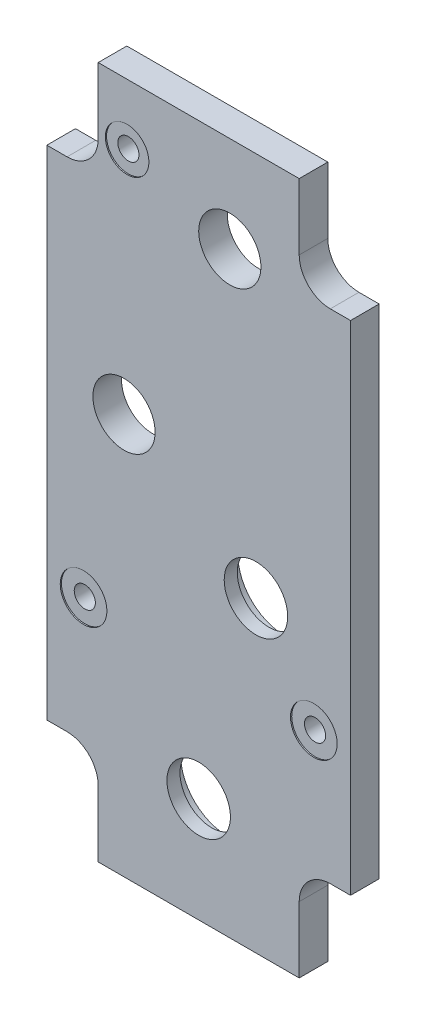
ISO-10303-21;
HEADER;
FILE_DESCRIPTION(('STEP AP214'),'2;1');
FILE_NAME('part.step','',(''),(''),'','','');
FILE_SCHEMA(('AUTOMOTIVE_DESIGN { 1 0 10303 214 1 1 1 1 }'));
ENDSEC;
DATA;
#1=APPLICATION_CONTEXT('core data for automotive mechanical design processes');
#2=APPLICATION_PROTOCOL_DEFINITION('international standard','automotive_design',2000,#1);
#3=PRODUCT_CONTEXT('',#1,'mechanical');
#4=PRODUCT('Part','Part','',(#3));
#5=PRODUCT_RELATED_PRODUCT_CATEGORY('part','',(#4));
#6=PRODUCT_DEFINITION_FORMATION('','',#4);
#7=PRODUCT_DEFINITION_CONTEXT('part definition',#1,'design');
#8=PRODUCT_DEFINITION('design','',#6,#7);
#9=PRODUCT_DEFINITION_SHAPE('','',#8);
#10=(LENGTH_UNIT() NAMED_UNIT(*) SI_UNIT(.MILLI.,.METRE.));
#11=(NAMED_UNIT(*) PLANE_ANGLE_UNIT() SI_UNIT($,.RADIAN.));
#12=(NAMED_UNIT(*) SI_UNIT($,.STERADIAN.) SOLID_ANGLE_UNIT());
#13=UNCERTAINTY_MEASURE_WITH_UNIT(LENGTH_MEASURE(1.E-05),#10,'distance_accuracy_value','');
#14=(GEOMETRIC_REPRESENTATION_CONTEXT(3) GLOBAL_UNCERTAINTY_ASSIGNED_CONTEXT((#13)) GLOBAL_UNIT_ASSIGNED_CONTEXT((#10,
#11,#12)) REPRESENTATION_CONTEXT('',''));
#15=CARTESIAN_POINT('',(0.,0.,0.));
#16=DIRECTION('',(0.,0.,1.));
#17=DIRECTION('',(1.,0.,0.));
#18=AXIS2_PLACEMENT_3D('',#15,#16,#17);
#19=CARTESIAN_POINT('',(8.255,55.5625,7.4676));
#20=DIRECTION('',(0.,0.,-1.));
#21=DIRECTION('',(-1.,0.,0.));
#22=AXIS2_PLACEMENT_3D('',#19,#20,#21);
#23=CYLINDRICAL_SURFACE('',#22,2.159);
#24=CARTESIAN_POINT('',(8.255,55.5625,1.6256));
#25=DIRECTION('',(0.,0.,-1.));
#26=DIRECTION('',(-1.,0.,0.));
#27=AXIS2_PLACEMENT_3D('',#24,#25,#26);
#28=CIRCLE('',#27,2.159);
#29=CARTESIAN_POINT('',(6.096,55.5625,1.6256));
#30=VERTEX_POINT('',#29);
#31=EDGE_CURVE('E323',#30,#30,#28,.T.);
#32=ORIENTED_EDGE('',*,*,#31,.T.);
#33=EDGE_LOOP('',(#32));
#34=FACE_BOUND('',#33,.T.);
#35=CARTESIAN_POINT('',(8.255,55.5625,7.2136));
#36=DIRECTION('',(0.,0.,-1.));
#37=DIRECTION('',(-1.,0.,0.));
#38=AXIS2_PLACEMENT_3D('',#35,#36,#37);
#39=CIRCLE('',#38,2.159);
#40=CARTESIAN_POINT('',(6.096,55.5625,7.2136));
#41=VERTEX_POINT('',#40);
#42=EDGE_CURVE('E20',#41,#41,#39,.T.);
#43=ORIENTED_EDGE('',*,*,#42,.F.);
#44=EDGE_LOOP('',(#43));
#45=FACE_BOUND('',#44,.T.);
#46=ADVANCED_FACE('F17',(#34,#45),#23,.F.);
#47=CARTESIAN_POINT('',(55.245,55.5625,7.4676));
#48=DIRECTION('',(0.,0.,-1.));
#49=DIRECTION('',(-1.,0.,0.));
#50=AXIS2_PLACEMENT_3D('',#47,#48,#49);
#51=CYLINDRICAL_SURFACE('',#50,2.15900000000001);
#52=CARTESIAN_POINT('',(55.245,55.5625,1.6256));
#53=DIRECTION('',(0.,0.,-1.));
#54=DIRECTION('',(-1.,0.,0.));
#55=AXIS2_PLACEMENT_3D('',#52,#53,#54);
#56=CIRCLE('',#55,2.15900000000001);
#57=CARTESIAN_POINT('',(53.086,55.5625,1.6256));
#58=VERTEX_POINT('',#57);
#59=EDGE_CURVE('E320',#58,#58,#56,.T.);
#60=ORIENTED_EDGE('',*,*,#59,.T.);
#61=EDGE_LOOP('',(#60));
#62=FACE_BOUND('',#61,.T.);
#63=CARTESIAN_POINT('',(55.245,55.5625,7.2136));
#64=DIRECTION('',(0.,0.,-1.));
#65=DIRECTION('',(-1.,0.,0.));
#66=AXIS2_PLACEMENT_3D('',#63,#64,#65);
#67=CIRCLE('',#66,2.15900000000001);
#68=CARTESIAN_POINT('',(53.086,55.5625,7.2136));
#69=VERTEX_POINT('',#68);
#70=EDGE_CURVE('E335',#69,#69,#67,.T.);
#71=ORIENTED_EDGE('',*,*,#70,.F.);
#72=EDGE_LOOP('',(#71));
#73=FACE_BOUND('',#72,.T.);
#74=ADVANCED_FACE('F346',(#62,#73),#51,.F.);
#75=CARTESIAN_POINT('',(17.145,139.192,7.4676));
#76=DIRECTION('',(0.,0.,-1.));
#77=DIRECTION('',(-1.,0.,0.));
#78=AXIS2_PLACEMENT_3D('',#75,#76,#77);
#79=CYLINDRICAL_SURFACE('',#78,2.159);
#80=CARTESIAN_POINT('',(17.145,139.192,1.6256));
#81=DIRECTION('',(0.,0.,-1.));
#82=DIRECTION('',(-1.,0.,0.));
#83=AXIS2_PLACEMENT_3D('',#80,#81,#82);
#84=CIRCLE('',#83,2.159);
#85=CARTESIAN_POINT('',(14.986,139.192,1.6256));
#86=VERTEX_POINT('',#85);
#87=EDGE_CURVE('E317',#86,#86,#84,.T.);
#88=ORIENTED_EDGE('',*,*,#87,.T.);
#89=EDGE_LOOP('',(#88));
#90=FACE_BOUND('',#89,.T.);
#91=CARTESIAN_POINT('',(17.145,139.192,7.2136));
#92=DIRECTION('',(0.,0.,-1.));
#93=DIRECTION('',(-1.,0.,0.));
#94=AXIS2_PLACEMENT_3D('',#91,#92,#93);
#95=CIRCLE('',#94,2.159);
#96=CARTESIAN_POINT('',(14.986,139.192,7.2136));
#97=VERTEX_POINT('',#96);
#98=EDGE_CURVE('E333',#97,#97,#95,.T.);
#99=ORIENTED_EDGE('',*,*,#98,.F.);
#100=EDGE_LOOP('',(#99));
#101=FACE_BOUND('',#100,.T.);
#102=ADVANCED_FACE('F352',(#90,#101),#79,.F.);
#103=CARTESIAN_POINT('',(31.75,31.75,1.6256));
#104=DIRECTION('',(0.,0.,1.));
#105=DIRECTION('',(1.,0.,0.));
#106=AXIS2_PLACEMENT_3D('',#103,#104,#105);
#107=CYLINDRICAL_SURFACE('',#106,9.525);
#108=CARTESIAN_POINT('',(31.75,31.75,4.8006));
#109=DIRECTION('',(0.,0.,1.));
#110=DIRECTION('',(1.,0.,0.));
#111=AXIS2_PLACEMENT_3D('',#108,#109,#110);
#112=CIRCLE('',#111,9.525);
#113=CARTESIAN_POINT('',(41.275,31.75,4.8006));
#114=VERTEX_POINT('',#113);
#115=EDGE_CURVE('E326',#114,#114,#112,.F.);
#116=ORIENTED_EDGE('',*,*,#115,.F.);
#117=EDGE_LOOP('',(#116));
#118=FACE_BOUND('',#117,.T.);
#119=CARTESIAN_POINT('',(31.75,31.75,1.6256));
#120=DIRECTION('',(0.,0.,1.));
#121=DIRECTION('',(1.,0.,0.));
#122=AXIS2_PLACEMENT_3D('',#119,#120,#121);
#123=CIRCLE('',#122,9.525);
#124=CARTESIAN_POINT('',(41.275,31.75,1.6256));
#125=VERTEX_POINT('',#124);
#126=EDGE_CURVE('E314',#125,#125,#123,.F.);
#127=ORIENTED_EDGE('',*,*,#126,.T.);
#128=EDGE_LOOP('',(#127));
#129=FACE_BOUND('',#128,.T.);
#130=ADVANCED_FACE('F470',(#118,#129),#107,.F.);
#131=CARTESIAN_POINT('',(43.434,73.025,1.6256));
#132=DIRECTION('',(0.,0.,1.));
#133=DIRECTION('',(1.,0.,0.));
#134=AXIS2_PLACEMENT_3D('',#131,#132,#133);
#135=CYLINDRICAL_SURFACE('',#134,9.525);
#136=CARTESIAN_POINT('',(43.434,73.025,4.8006));
#137=DIRECTION('',(0.,0.,1.));
#138=DIRECTION('',(1.,0.,0.));
#139=AXIS2_PLACEMENT_3D('',#136,#137,#138);
#140=CIRCLE('',#139,9.525);
#141=CARTESIAN_POINT('',(52.959,73.025,4.8006));
#142=VERTEX_POINT('',#141);
#143=EDGE_CURVE('E329',#142,#142,#140,.F.);
#144=ORIENTED_EDGE('',*,*,#143,.F.);
#145=EDGE_LOOP('',(#144));
#146=FACE_BOUND('',#145,.T.);
#147=CARTESIAN_POINT('',(43.434,73.025,1.6256));
#148=DIRECTION('',(0.,0.,1.));
#149=DIRECTION('',(1.,0.,0.));
#150=AXIS2_PLACEMENT_3D('',#147,#148,#149);
#151=CIRCLE('',#150,9.525);
#152=CARTESIAN_POINT('',(52.959,73.025,1.6256));
#153=VERTEX_POINT('',#152);
#154=EDGE_CURVE('E197',#153,#153,#151,.F.);
#155=ORIENTED_EDGE('',*,*,#154,.T.);
#156=EDGE_LOOP('',(#155));
#157=FACE_BOUND('',#156,.T.);
#158=ADVANCED_FACE('F467',(#146,#157),#135,.F.);
#159=CARTESIAN_POINT('',(8.255,55.5625,7.2136));
#160=DIRECTION('',(0.,0.,1.));
#161=DIRECTION('',(1.,0.,0.));
#162=AXIS2_PLACEMENT_3D('',#159,#160,#161);
#163=PLANE('',#162);
#164=ORIENTED_EDGE('',*,*,#42,.T.);
#165=EDGE_LOOP('',(#164));
#166=FACE_BOUND('',#165,.T.);
#167=CARTESIAN_POINT('',(8.255,55.5625,7.2136));
#168=DIRECTION('',(0.,0.,-1.));
#169=DIRECTION('',(-1.,0.,0.));
#170=AXIS2_PLACEMENT_3D('',#167,#168,#169);
#171=CIRCLE('',#170,4.7625);
#172=CARTESIAN_POINT('',(3.4925,55.5625,7.2136));
#173=VERTEX_POINT('',#172);
#174=EDGE_CURVE('E300',#173,#173,#171,.F.);
#175=ORIENTED_EDGE('',*,*,#174,.T.);
#176=EDGE_LOOP('',(#175));
#177=FACE_BOUND('',#176,.T.);
#178=ADVANCED_FACE('F342',(#166,#177),#163,.T.);
#179=CARTESIAN_POINT('',(55.245,55.5625,7.2136));
#180=DIRECTION('',(0.,0.,1.));
#181=DIRECTION('',(1.,0.,0.));
#182=AXIS2_PLACEMENT_3D('',#179,#180,#181);
#183=PLANE('',#182);
#184=ORIENTED_EDGE('',*,*,#70,.T.);
#185=EDGE_LOOP('',(#184));
#186=FACE_BOUND('',#185,.T.);
#187=CARTESIAN_POINT('',(55.245,55.5625,7.2136));
#188=DIRECTION('',(0.,0.,-1.));
#189=DIRECTION('',(-1.,0.,0.));
#190=AXIS2_PLACEMENT_3D('',#187,#188,#189);
#191=CIRCLE('',#190,4.7625);
#192=CARTESIAN_POINT('',(50.4825,55.5625,7.2136));
#193=VERTEX_POINT('',#192);
#194=EDGE_CURVE('E297',#193,#193,#191,.F.);
#195=ORIENTED_EDGE('',*,*,#194,.T.);
#196=EDGE_LOOP('',(#195));
#197=FACE_BOUND('',#196,.T.);
#198=ADVANCED_FACE('F461',(#186,#197),#183,.T.);
#199=CARTESIAN_POINT('',(17.145,139.192,7.2136));
#200=DIRECTION('',(0.,0.,1.));
#201=DIRECTION('',(1.,0.,0.));
#202=AXIS2_PLACEMENT_3D('',#199,#200,#201);
#203=PLANE('',#202);
#204=ORIENTED_EDGE('',*,*,#98,.T.);
#205=EDGE_LOOP('',(#204));
#206=FACE_BOUND('',#205,.T.);
#207=CARTESIAN_POINT('',(17.145,139.192,7.2136));
#208=DIRECTION('',(0.,0.,-1.));
#209=DIRECTION('',(-1.,0.,0.));
#210=AXIS2_PLACEMENT_3D('',#207,#208,#209);
#211=CIRCLE('',#210,4.445);
#212=CARTESIAN_POINT('',(12.7,139.192,7.2136));
#213=VERTEX_POINT('',#212);
#214=EDGE_CURVE('E294',#213,#213,#211,.F.);
#215=ORIENTED_EDGE('',*,*,#214,.T.);
#216=EDGE_LOOP('',(#215));
#217=FACE_BOUND('',#216,.T.);
#218=ADVANCED_FACE('F457',(#206,#217),#203,.T.);
#219=CARTESIAN_POINT('',(43.434,73.025,4.8006));
#220=DIRECTION('',(0.,0.,-1.));
#221=DIRECTION('',(-1.,0.,0.));
#222=AXIS2_PLACEMENT_3D('',#219,#220,#221);
#223=PLANE('',#222);
#224=CARTESIAN_POINT('',(43.434,73.025,4.8006));
#225=DIRECTION('',(0.,0.,-1.));
#226=DIRECTION('',(-1.,0.,0.));
#227=AXIS2_PLACEMENT_3D('',#224,#225,#226);
#228=CIRCLE('',#227,6.477);
#229=CARTESIAN_POINT('',(36.957,73.025,4.8006));
#230=VERTEX_POINT('',#229);
#231=EDGE_CURVE('E290',#230,#230,#228,.F.);
#232=ORIENTED_EDGE('',*,*,#231,.T.);
#233=EDGE_LOOP('',(#232));
#234=FACE_BOUND('',#233,.T.);
#235=ORIENTED_EDGE('',*,*,#143,.T.);
#236=EDGE_LOOP('',(#235));
#237=FACE_BOUND('',#236,.T.);
#238=ADVANCED_FACE('F453',(#234,#237),#223,.T.);
#239=CARTESIAN_POINT('',(31.75,31.75,4.8006));
#240=DIRECTION('',(0.,0.,-1.));
#241=DIRECTION('',(-1.,0.,0.));
#242=AXIS2_PLACEMENT_3D('',#239,#240,#241);
#243=PLANE('',#242);
#244=CARTESIAN_POINT('',(31.75,31.75,4.8006));
#245=DIRECTION('',(0.,0.,-1.));
#246=DIRECTION('',(-1.,0.,0.));
#247=AXIS2_PLACEMENT_3D('',#244,#245,#246);
#248=CIRCLE('',#247,6.477);
#249=CARTESIAN_POINT('',(25.273,31.75,4.8006));
#250=VERTEX_POINT('',#249);
#251=EDGE_CURVE('E284',#250,#250,#248,.F.);
#252=ORIENTED_EDGE('',*,*,#251,.T.);
#253=EDGE_LOOP('',(#252));
#254=FACE_BOUND('',#253,.T.);
#255=ORIENTED_EDGE('',*,*,#115,.T.);
#256=EDGE_LOOP('',(#255));
#257=FACE_BOUND('',#256,.T.);
#258=ADVANCED_FACE('F449',(#254,#257),#243,.T.);
#259=CARTESIAN_POINT('',(31.75,80.9625,1.6256));
#260=DIRECTION('',(0.,0.,1.));
#261=DIRECTION('',(1.,0.,0.));
#262=AXIS2_PLACEMENT_3D('',#259,#260,#261);
#263=PLANE('',#262);
#264=CARTESIAN_POINT('',(38.1,132.08,1.6256));
#265=DIRECTION('',(0.,0.,-1.));
#266=DIRECTION('',(-1.,0.,0.));
#267=AXIS2_PLACEMENT_3D('',#264,#265,#266);
#268=CIRCLE('',#267,6.35);
#269=CARTESIAN_POINT('',(31.75,132.08,1.6256));
#270=VERTEX_POINT('',#269);
#271=EDGE_CURVE('E281',#270,#270,#268,.F.);
#272=ORIENTED_EDGE('',*,*,#271,.T.);
#273=EDGE_LOOP('',(#272));
#274=FACE_BOUND('',#273,.T.);
#275=CARTESIAN_POINT('',(16.51,92.075,1.6256));
#276=DIRECTION('',(0.,0.,-1.));
#277=DIRECTION('',(-1.,0.,0.));
#278=AXIS2_PLACEMENT_3D('',#275,#276,#277);
#279=CIRCLE('',#278,6.35);
#280=CARTESIAN_POINT('',(10.16,92.075,1.6256));
#281=VERTEX_POINT('',#280);
#282=EDGE_CURVE('E287',#281,#281,#279,.F.);
#283=ORIENTED_EDGE('',*,*,#282,.T.);
#284=EDGE_LOOP('',(#283));
#285=FACE_BOUND('',#284,.T.);
#286=ORIENTED_EDGE('',*,*,#154,.F.);
#287=EDGE_LOOP('',(#286));
#288=FACE_BOUND('',#287,.T.);
#289=ORIENTED_EDGE('',*,*,#126,.F.);
#290=EDGE_LOOP('',(#289));
#291=FACE_BOUND('',#290,.T.);
#292=ORIENTED_EDGE('',*,*,#87,.F.);
#293=EDGE_LOOP('',(#292));
#294=FACE_BOUND('',#293,.T.);
#295=ORIENTED_EDGE('',*,*,#59,.F.);
#296=EDGE_LOOP('',(#295));
#297=FACE_BOUND('',#296,.T.);
#298=ORIENTED_EDGE('',*,*,#31,.F.);
#299=EDGE_LOOP('',(#298));
#300=FACE_BOUND('',#299,.T.);
#301=DIRECTION('',(0.,1.,0.));
#302=VECTOR('',#301,1.);
#303=CARTESIAN_POINT('',(11.2394999999999,23.8125,1.6256));
#304=LINE('',#303,#302);
#305=CARTESIAN_POINT('',(11.2394999999999,23.8125,1.6256));
#306=VERTEX_POINT('',#305);
#307=CARTESIAN_POINT('',(11.2394999999999,10.31875,1.6256));
#308=VERTEX_POINT('',#307);
#309=EDGE_CURVE('E189',#306,#308,#304,.F.);
#310=ORIENTED_EDGE('',*,*,#309,.F.);
#311=CARTESIAN_POINT('',(4.88949999999995,23.8125,1.6256));
#312=DIRECTION('',(0.,0.,1.));
#313=DIRECTION('',(1.,0.,0.));
#314=AXIS2_PLACEMENT_3D('',#311,#312,#313);
#315=CIRCLE('',#314,6.35);
#316=CARTESIAN_POINT('',(4.88949999999992,30.1625,1.6256));
#317=VERTEX_POINT('',#316);
#318=EDGE_CURVE('E193',#306,#317,#315,.T.);
#319=ORIENTED_EDGE('',*,*,#318,.T.);
#320=DIRECTION('',(1.,0.,0.));
#321=VECTOR('',#320,1.);
#322=CARTESIAN_POINT('',(0.76200000000003,30.1625,1.6256));
#323=LINE('',#322,#321);
#324=CARTESIAN_POINT('',(0.762000000000034,30.1625,1.6256));
#325=VERTEX_POINT('',#324);
#326=EDGE_CURVE('E200',#325,#317,#323,.T.);
#327=ORIENTED_EDGE('',*,*,#326,.F.);
#328=DIRECTION('',(0.,-1.,0.));
#329=VECTOR('',#328,1.);
#330=CARTESIAN_POINT('',(0.76199999999986,131.7625,1.6256));
#331=LINE('',#330,#329);
#332=CARTESIAN_POINT('',(0.76199999999986,131.7625,1.6256));
#333=VERTEX_POINT('',#332);
#334=EDGE_CURVE('E206',#333,#325,#331,.T.);
#335=ORIENTED_EDGE('',*,*,#334,.F.);
#336=DIRECTION('',(-1.,0.,0.));
#337=VECTOR('',#336,1.);
#338=CARTESIAN_POINT('',(4.88949999999995,131.7625,1.6256));
#339=LINE('',#338,#337);
#340=CARTESIAN_POINT('',(4.88949999999992,131.7625,1.6256));
#341=VERTEX_POINT('',#340);
#342=EDGE_CURVE('E212',#341,#333,#339,.T.);
#343=ORIENTED_EDGE('',*,*,#342,.F.);
#344=CARTESIAN_POINT('',(4.88949999999995,138.1125,1.6256));
#345=DIRECTION('',(0.,0.,1.));
#346=DIRECTION('',(1.,0.,0.));
#347=AXIS2_PLACEMENT_3D('',#344,#345,#346);
#348=CIRCLE('',#347,6.35);
#349=CARTESIAN_POINT('',(11.2394999999999,138.1125,1.6256));
#350=VERTEX_POINT('',#349);
#351=EDGE_CURVE('E215',#341,#350,#348,.T.);
#352=ORIENTED_EDGE('',*,*,#351,.T.);
#353=DIRECTION('',(0.,1.,0.));
#354=VECTOR('',#353,1.);
#355=CARTESIAN_POINT('',(11.2394999999999,151.60625,1.6256));
#356=LINE('',#355,#354);
#357=CARTESIAN_POINT('',(11.2395,151.60625,1.6256));
#358=VERTEX_POINT('',#357);
#359=EDGE_CURVE('E218',#358,#350,#356,.F.);
#360=ORIENTED_EDGE('',*,*,#359,.F.);
#361=DIRECTION('',(-1.,0.,0.));
#362=VECTOR('',#361,1.);
#363=CARTESIAN_POINT('',(52.2605,151.60625,1.6256));
#364=LINE('',#363,#362);
#365=CARTESIAN_POINT('',(52.2605,151.60625,1.6256));
#366=VERTEX_POINT('',#365);
#367=EDGE_CURVE('E224',#366,#358,#364,.T.);
#368=ORIENTED_EDGE('',*,*,#367,.F.);
#369=DIRECTION('',(0.,1.,0.));
#370=VECTOR('',#369,1.);
#371=CARTESIAN_POINT('',(52.2605,138.1125,1.6256));
#372=LINE('',#371,#370);
#373=CARTESIAN_POINT('',(52.2605,138.1125,1.6256));
#374=VERTEX_POINT('',#373);
#375=EDGE_CURVE('E230',#374,#366,#372,.T.);
#376=ORIENTED_EDGE('',*,*,#375,.F.);
#377=CARTESIAN_POINT('',(58.6105,138.1125,1.6256));
#378=DIRECTION('',(0.,0.,1.));
#379=DIRECTION('',(1.,0.,0.));
#380=AXIS2_PLACEMENT_3D('',#377,#378,#379);
#381=CIRCLE('',#380,6.35);
#382=CARTESIAN_POINT('',(58.6105,131.7625,1.6256));
#383=VERTEX_POINT('',#382);
#384=EDGE_CURVE('E147',#374,#383,#381,.T.);
#385=ORIENTED_EDGE('',*,*,#384,.T.);
#386=DIRECTION('',(-1.,0.,0.));
#387=VECTOR('',#386,1.);
#388=CARTESIAN_POINT('',(62.738,131.7625,1.6256));
#389=LINE('',#388,#387);
#390=CARTESIAN_POINT('',(62.738,131.7625,1.6256));
#391=VERTEX_POINT('',#390);
#392=EDGE_CURVE('E142',#391,#383,#389,.T.);
#393=ORIENTED_EDGE('',*,*,#392,.F.);
#394=DIRECTION('',(0.,1.,0.));
#395=VECTOR('',#394,1.);
#396=CARTESIAN_POINT('',(62.738,30.1625,1.6256));
#397=LINE('',#396,#395);
#398=CARTESIAN_POINT('',(62.738,30.1625,1.6256));
#399=VERTEX_POINT('',#398);
#400=EDGE_CURVE('E145',#399,#391,#397,.T.);
#401=ORIENTED_EDGE('',*,*,#400,.F.);
#402=DIRECTION('',(1.,0.,0.));
#403=VECTOR('',#402,1.);
#404=CARTESIAN_POINT('',(58.6105,30.1625,1.6256));
#405=LINE('',#404,#403);
#406=CARTESIAN_POINT('',(58.6105,30.1625,1.6256));
#407=VERTEX_POINT('',#406);
#408=EDGE_CURVE('E96',#407,#399,#405,.T.);
#409=ORIENTED_EDGE('',*,*,#408,.F.);
#410=CARTESIAN_POINT('',(58.6105,23.8125,1.6256));
#411=DIRECTION('',(0.,0.,1.));
#412=DIRECTION('',(1.,0.,0.));
#413=AXIS2_PLACEMENT_3D('',#410,#411,#412);
#414=CIRCLE('',#413,6.35);
#415=CARTESIAN_POINT('',(52.2605,23.8125,1.6256));
#416=VERTEX_POINT('',#415);
#417=EDGE_CURVE('E184',#407,#416,#414,.T.);
#418=ORIENTED_EDGE('',*,*,#417,.T.);
#419=DIRECTION('',(0.,1.,0.));
#420=VECTOR('',#419,1.);
#421=CARTESIAN_POINT('',(52.2605,10.31875,1.6256));
#422=LINE('',#421,#420);
#423=CARTESIAN_POINT('',(52.2605,10.3187500000001,1.6256));
#424=VERTEX_POINT('',#423);
#425=EDGE_CURVE('E104',#424,#416,#422,.T.);
#426=ORIENTED_EDGE('',*,*,#425,.F.);
#427=DIRECTION('',(1.,0.,0.));
#428=VECTOR('',#427,1.);
#429=CARTESIAN_POINT('',(11.2394999999999,10.31875,1.6256));
#430=LINE('',#429,#428);
#431=EDGE_CURVE('E110',#308,#424,#430,.T.);
#432=ORIENTED_EDGE('',*,*,#431,.F.);
#433=EDGE_LOOP('',(#310,#319,#327,#335,#343,#352,#360,#368,#376,#385,#393,#401,#409,#418,#426,#432));
#434=FACE_BOUND('',#433,.T.);
#435=ADVANCED_FACE('F144',(#274,#285,#288,#291,#294,#297,#300,#434),#263,.F.);
#436=CARTESIAN_POINT('',(11.2394999999999,10.31875,1.6256));
#437=DIRECTION('',(0.,-1.,0.));
#438=DIRECTION('',(1.,0.,0.));
#439=AXIS2_PLACEMENT_3D('',#436,#437,#438);
#440=PLANE('',#439);
#441=DIRECTION('',(1.,0.,0.));
#442=VECTOR('',#441,1.);
#443=CARTESIAN_POINT('',(31.75,10.31875,7.4676));
#444=LINE('',#443,#442);
#445=CARTESIAN_POINT('',(11.2395,10.31875,7.4676));
#446=VERTEX_POINT('',#445);
#447=CARTESIAN_POINT('',(52.2605,10.31875,7.4676));
#448=VERTEX_POINT('',#447);
#449=EDGE_CURVE('E117',#446,#448,#444,.T.);
#450=ORIENTED_EDGE('',*,*,#449,.F.);
#451=DIRECTION('',(0.,0.,1.));
#452=VECTOR('',#451,1.);
#453=CARTESIAN_POINT('',(11.2394999999999,10.31875,1.6256));
#454=LINE('',#453,#452);
#455=EDGE_CURVE('E192',#308,#446,#454,.T.);
#456=ORIENTED_EDGE('',*,*,#455,.F.);
#457=ORIENTED_EDGE('',*,*,#431,.T.);
#458=DIRECTION('',(0.,0.,1.));
#459=VECTOR('',#458,1.);
#460=CARTESIAN_POINT('',(52.2605,10.31875,1.6256));
#461=LINE('',#460,#459);
#462=EDGE_CURVE('E185',#448,#424,#461,.F.);
#463=ORIENTED_EDGE('',*,*,#462,.F.);
#464=EDGE_LOOP('',(#450,#456,#457,#463));
#465=FACE_BOUND('',#464,.T.);
#466=ADVANCED_FACE('F444',(#465),#440,.T.);
#467=CARTESIAN_POINT('',(52.2605,10.31875,1.6256));
#468=DIRECTION('',(1.,0.,0.));
#469=DIRECTION('',(0.,1.,0.));
#470=AXIS2_PLACEMENT_3D('',#467,#468,#469);
#471=PLANE('',#470);
#472=DIRECTION('',(0.,1.,0.));
#473=VECTOR('',#472,1.);
#474=CARTESIAN_POINT('',(52.2605,80.9625,7.4676));
#475=LINE('',#474,#473);
#476=CARTESIAN_POINT('',(52.2605,23.8125,7.4676));
#477=VERTEX_POINT('',#476);
#478=EDGE_CURVE('E280',#448,#477,#475,.T.);
#479=ORIENTED_EDGE('',*,*,#478,.F.);
#480=ORIENTED_EDGE('',*,*,#462,.T.);
#481=ORIENTED_EDGE('',*,*,#425,.T.);
#482=DIRECTION('',(0.,0.,1.));
#483=VECTOR('',#482,1.);
#484=CARTESIAN_POINT('',(52.2605,23.8125,1.6256));
#485=LINE('',#484,#483);
#486=EDGE_CURVE('E182',#416,#477,#485,.T.);
#487=ORIENTED_EDGE('',*,*,#486,.T.);
#488=EDGE_LOOP('',(#479,#480,#481,#487));
#489=FACE_BOUND('',#488,.T.);
#490=ADVANCED_FACE('F440',(#489),#471,.T.);
#491=CARTESIAN_POINT('',(58.6105,23.8125,1.6256));
#492=DIRECTION('',(0.,0.,1.));
#493=DIRECTION('',(1.,0.,0.));
#494=AXIS2_PLACEMENT_3D('',#491,#492,#493);
#495=CYLINDRICAL_SURFACE('',#494,6.35);
#496=DIRECTION('',(0.,0.,1.));
#497=VECTOR('',#496,1.);
#498=CARTESIAN_POINT('',(58.6105,30.1625,1.6256));
#499=LINE('',#498,#497);
#500=CARTESIAN_POINT('',(58.6105,30.1625,7.4676));
#501=VERTEX_POINT('',#500);
#502=EDGE_CURVE('E159',#501,#407,#499,.F.);
#503=ORIENTED_EDGE('',*,*,#502,.F.);
#504=CARTESIAN_POINT('',(58.6105,23.8125,7.4676));
#505=DIRECTION('',(0.,0.,1.));
#506=DIRECTION('',(1.,0.,0.));
#507=AXIS2_PLACEMENT_3D('',#504,#505,#506);
#508=CIRCLE('',#507,6.35);
#509=EDGE_CURVE('E277',#477,#501,#508,.F.);
#510=ORIENTED_EDGE('',*,*,#509,.F.);
#511=ORIENTED_EDGE('',*,*,#486,.F.);
#512=ORIENTED_EDGE('',*,*,#417,.F.);
#513=EDGE_LOOP('',(#503,#510,#511,#512));
#514=FACE_BOUND('',#513,.T.);
#515=ADVANCED_FACE('F436',(#514),#495,.F.);
#516=CARTESIAN_POINT('',(58.6105,30.1625,1.6256));
#517=DIRECTION('',(0.,-1.,0.));
#518=DIRECTION('',(1.,0.,0.));
#519=AXIS2_PLACEMENT_3D('',#516,#517,#518);
#520=PLANE('',#519);
#521=DIRECTION('',(1.,0.,0.));
#522=VECTOR('',#521,1.);
#523=CARTESIAN_POINT('',(31.75,30.1625,7.4676));
#524=LINE('',#523,#522);
#525=CARTESIAN_POINT('',(62.738,30.1625,7.4676));
#526=VERTEX_POINT('',#525);
#527=EDGE_CURVE('E174',#501,#526,#524,.T.);
#528=ORIENTED_EDGE('',*,*,#527,.F.);
#529=ORIENTED_EDGE('',*,*,#502,.T.);
#530=ORIENTED_EDGE('',*,*,#408,.T.);
#531=DIRECTION('',(0.,0.,1.));
#532=VECTOR('',#531,1.);
#533=CARTESIAN_POINT('',(62.738,30.1625,1.6256));
#534=LINE('',#533,#532);
#535=EDGE_CURVE('E152',#526,#399,#534,.F.);
#536=ORIENTED_EDGE('',*,*,#535,.F.);
#537=EDGE_LOOP('',(#528,#529,#530,#536));
#538=FACE_BOUND('',#537,.T.);
#539=ADVANCED_FACE('F433',(#538),#520,.T.);
#540=CARTESIAN_POINT('',(62.738,30.1625,1.6256));
#541=DIRECTION('',(1.,0.,0.));
#542=DIRECTION('',(0.,1.,0.));
#543=AXIS2_PLACEMENT_3D('',#540,#541,#542);
#544=PLANE('',#543);
#545=DIRECTION('',(0.,1.,0.));
#546=VECTOR('',#545,1.);
#547=CARTESIAN_POINT('',(62.738,80.9625,7.4676));
#548=LINE('',#547,#546);
#549=CARTESIAN_POINT('',(62.738,131.7625,7.4676));
#550=VERTEX_POINT('',#549);
#551=EDGE_CURVE('E172',#526,#550,#548,.T.);
#552=ORIENTED_EDGE('',*,*,#551,.F.);
#553=ORIENTED_EDGE('',*,*,#535,.T.);
#554=ORIENTED_EDGE('',*,*,#400,.T.);
#555=DIRECTION('',(0.,0.,1.));
#556=VECTOR('',#555,1.);
#557=CARTESIAN_POINT('',(62.738,131.7625,1.6256));
#558=LINE('',#557,#556);
#559=EDGE_CURVE('E151',#550,#391,#558,.F.);
#560=ORIENTED_EDGE('',*,*,#559,.F.);
#561=EDGE_LOOP('',(#552,#553,#554,#560));
#562=FACE_BOUND('',#561,.T.);
#563=ADVANCED_FACE('F157',(#562),#544,.T.);
#564=CARTESIAN_POINT('',(62.738,131.7625,1.6256));
#565=DIRECTION('',(0.,1.,0.));
#566=DIRECTION('',(-1.,0.,0.));
#567=AXIS2_PLACEMENT_3D('',#564,#565,#566);
#568=PLANE('',#567);
#569=DIRECTION('',(1.,0.,0.));
#570=VECTOR('',#569,1.);
#571=CARTESIAN_POINT('',(31.75,131.7625,7.4676));
#572=LINE('',#571,#570);
#573=CARTESIAN_POINT('',(58.6105,131.7625,7.4676));
#574=VERTEX_POINT('',#573);
#575=EDGE_CURVE('E163',#550,#574,#572,.F.);
#576=ORIENTED_EDGE('',*,*,#575,.F.);
#577=ORIENTED_EDGE('',*,*,#559,.T.);
#578=ORIENTED_EDGE('',*,*,#392,.T.);
#579=DIRECTION('',(0.,0.,1.));
#580=VECTOR('',#579,1.);
#581=CARTESIAN_POINT('',(58.6105,131.7625,1.6256));
#582=LINE('',#581,#580);
#583=EDGE_CURVE('E165',#383,#574,#582,.T.);
#584=ORIENTED_EDGE('',*,*,#583,.T.);
#585=EDGE_LOOP('',(#576,#577,#578,#584));
#586=FACE_BOUND('',#585,.T.);
#587=ADVANCED_FACE('F161',(#586),#568,.T.);
#588=CARTESIAN_POINT('',(58.6105,138.1125,1.6256));
#589=DIRECTION('',(0.,0.,1.));
#590=DIRECTION('',(1.,0.,0.));
#591=AXIS2_PLACEMENT_3D('',#588,#589,#590);
#592=CYLINDRICAL_SURFACE('',#591,6.35);
#593=DIRECTION('',(0.,0.,-1.));
#594=VECTOR('',#593,1.);
#595=CARTESIAN_POINT('',(52.2605,138.1125,1.6256));
#596=LINE('',#595,#594);
#597=CARTESIAN_POINT('',(52.2605,138.1125,7.4676));
#598=VERTEX_POINT('',#597);
#599=EDGE_CURVE('E227',#598,#374,#596,.T.);
#600=ORIENTED_EDGE('',*,*,#599,.F.);
#601=CARTESIAN_POINT('',(58.6105,138.1125,7.4676));
#602=DIRECTION('',(0.,0.,1.));
#603=DIRECTION('',(1.,0.,0.));
#604=AXIS2_PLACEMENT_3D('',#601,#602,#603);
#605=CIRCLE('',#604,6.35);
#606=EDGE_CURVE('E273',#574,#598,#605,.F.);
#607=ORIENTED_EDGE('',*,*,#606,.F.);
#608=ORIENTED_EDGE('',*,*,#583,.F.);
#609=ORIENTED_EDGE('',*,*,#384,.F.);
#610=EDGE_LOOP('',(#600,#607,#608,#609));
#611=FACE_BOUND('',#610,.T.);
#612=ADVANCED_FACE('F424',(#611),#592,.F.);
#613=CARTESIAN_POINT('',(52.2605,138.1125,1.6256));
#614=DIRECTION('',(1.,0.,0.));
#615=DIRECTION('',(0.,0.,-1.));
#616=AXIS2_PLACEMENT_3D('',#613,#614,#615);
#617=PLANE('',#616);
#618=DIRECTION('',(0.,1.,0.));
#619=VECTOR('',#618,1.);
#620=CARTESIAN_POINT('',(52.2605,80.9625,7.4676));
#621=LINE('',#620,#619);
#622=CARTESIAN_POINT('',(52.2605,151.60625,7.4676));
#623=VERTEX_POINT('',#622);
#624=EDGE_CURVE('E276',#598,#623,#621,.T.);
#625=ORIENTED_EDGE('',*,*,#624,.F.);
#626=ORIENTED_EDGE('',*,*,#599,.T.);
#627=ORIENTED_EDGE('',*,*,#375,.T.);
#628=DIRECTION('',(0.,0.,1.));
#629=VECTOR('',#628,1.);
#630=CARTESIAN_POINT('',(52.2605,151.60625,1.6256));
#631=LINE('',#630,#629);
#632=EDGE_CURVE('E221',#623,#366,#631,.F.);
#633=ORIENTED_EDGE('',*,*,#632,.F.);
#634=EDGE_LOOP('',(#625,#626,#627,#633));
#635=FACE_BOUND('',#634,.T.);
#636=ADVANCED_FACE('F420',(#635),#617,.T.);
#637=CARTESIAN_POINT('',(52.2605,151.60625,1.6256));
#638=DIRECTION('',(0.,1.,0.));
#639=DIRECTION('',(-1.,0.,0.));
#640=AXIS2_PLACEMENT_3D('',#637,#638,#639);
#641=PLANE('',#640);
#642=DIRECTION('',(1.,0.,0.));
#643=VECTOR('',#642,1.);
#644=CARTESIAN_POINT('',(31.75,151.60625,7.4676));
#645=LINE('',#644,#643);
#646=CARTESIAN_POINT('',(11.2395,151.60625,7.4676));
#647=VERTEX_POINT('',#646);
#648=EDGE_CURVE('E521',#623,#647,#645,.F.);
#649=ORIENTED_EDGE('',*,*,#648,.F.);
#650=ORIENTED_EDGE('',*,*,#632,.T.);
#651=ORIENTED_EDGE('',*,*,#367,.T.);
#652=DIRECTION('',(0.,0.,1.));
#653=VECTOR('',#652,1.);
#654=CARTESIAN_POINT('',(11.2394999999999,151.60625,1.6256));
#655=LINE('',#654,#653);
#656=EDGE_CURVE('E220',#647,#358,#655,.F.);
#657=ORIENTED_EDGE('',*,*,#656,.F.);
#658=EDGE_LOOP('',(#649,#650,#651,#657));
#659=FACE_BOUND('',#658,.T.);
#660=ADVANCED_FACE('F416',(#659),#641,.T.);
#661=CARTESIAN_POINT('',(11.2394999999999,151.60625,1.6256));
#662=DIRECTION('',(-1.,0.,0.));
#663=DIRECTION('',(0.,0.,1.));
#664=AXIS2_PLACEMENT_3D('',#661,#662,#663);
#665=PLANE('',#664);
#666=DIRECTION('',(0.,1.,0.));
#667=VECTOR('',#666,1.);
#668=CARTESIAN_POINT('',(11.2395,80.9625,7.4676));
#669=LINE('',#668,#667);
#670=CARTESIAN_POINT('',(11.2395,138.1125,7.4676));
#671=VERTEX_POINT('',#670);
#672=EDGE_CURVE('E272',#647,#671,#669,.F.);
#673=ORIENTED_EDGE('',*,*,#672,.F.);
#674=ORIENTED_EDGE('',*,*,#656,.T.);
#675=ORIENTED_EDGE('',*,*,#359,.T.);
#676=DIRECTION('',(0.,0.,1.));
#677=VECTOR('',#676,1.);
#678=CARTESIAN_POINT('',(11.2394999999999,138.1125,1.6256));
#679=LINE('',#678,#677);
#680=EDGE_CURVE('E308',#350,#671,#679,.T.);
#681=ORIENTED_EDGE('',*,*,#680,.T.);
#682=EDGE_LOOP('',(#673,#674,#675,#681));
#683=FACE_BOUND('',#682,.T.);
#684=ADVANCED_FACE('F412',(#683),#665,.T.);
#685=CARTESIAN_POINT('',(4.88949999999995,138.1125,1.6256));
#686=DIRECTION('',(0.,0.,1.));
#687=DIRECTION('',(1.,0.,0.));
#688=AXIS2_PLACEMENT_3D('',#685,#686,#687);
#689=CYLINDRICAL_SURFACE('',#688,6.35);
#690=DIRECTION('',(0.,0.,1.));
#691=VECTOR('',#690,1.);
#692=CARTESIAN_POINT('',(4.88949999999995,131.7625,1.6256));
#693=LINE('',#692,#691);
#694=CARTESIAN_POINT('',(4.88949999999995,131.7625,7.4676));
#695=VERTEX_POINT('',#694);
#696=EDGE_CURVE('E209',#695,#341,#693,.F.);
#697=ORIENTED_EDGE('',*,*,#696,.F.);
#698=CARTESIAN_POINT('',(4.88949999999995,138.1125,7.4676));
#699=DIRECTION('',(0.,0.,1.));
#700=DIRECTION('',(1.,0.,0.));
#701=AXIS2_PLACEMENT_3D('',#698,#699,#700);
#702=CIRCLE('',#701,6.35);
#703=EDGE_CURVE('E268',#671,#695,#702,.F.);
#704=ORIENTED_EDGE('',*,*,#703,.F.);
#705=ORIENTED_EDGE('',*,*,#680,.F.);
#706=ORIENTED_EDGE('',*,*,#351,.F.);
#707=EDGE_LOOP('',(#697,#704,#705,#706));
#708=FACE_BOUND('',#707,.T.);
#709=ADVANCED_FACE('F408',(#708),#689,.F.);
#710=CARTESIAN_POINT('',(4.88949999999995,131.7625,1.6256));
#711=DIRECTION('',(0.,1.,0.));
#712=DIRECTION('',(-1.,0.,0.));
#713=AXIS2_PLACEMENT_3D('',#710,#711,#712);
#714=PLANE('',#713);
#715=DIRECTION('',(1.,0.,0.));
#716=VECTOR('',#715,1.);
#717=CARTESIAN_POINT('',(31.75,131.7625,7.4676));
#718=LINE('',#717,#716);
#719=CARTESIAN_POINT('',(0.761999999999952,131.7625,7.4676));
#720=VERTEX_POINT('',#719);
#721=EDGE_CURVE('E271',#695,#720,#718,.F.);
#722=ORIENTED_EDGE('',*,*,#721,.F.);
#723=ORIENTED_EDGE('',*,*,#696,.T.);
#724=ORIENTED_EDGE('',*,*,#342,.T.);
#725=DIRECTION('',(0.,0.,1.));
#726=VECTOR('',#725,1.);
#727=CARTESIAN_POINT('',(0.76199999999986,131.7625,1.6256));
#728=LINE('',#727,#726);
#729=EDGE_CURVE('E203',#720,#333,#728,.F.);
#730=ORIENTED_EDGE('',*,*,#729,.F.);
#731=EDGE_LOOP('',(#722,#723,#724,#730));
#732=FACE_BOUND('',#731,.T.);
#733=ADVANCED_FACE('F404',(#732),#714,.T.);
#734=CARTESIAN_POINT('',(0.76199999999986,131.7625,1.6256));
#735=DIRECTION('',(-1.,0.,0.));
#736=DIRECTION('',(0.,-1.,0.));
#737=AXIS2_PLACEMENT_3D('',#734,#735,#736);
#738=PLANE('',#737);
#739=DIRECTION('',(0.,1.,0.));
#740=VECTOR('',#739,1.);
#741=CARTESIAN_POINT('',(0.761999999999999,80.9625,7.4676));
#742=LINE('',#741,#740);
#743=CARTESIAN_POINT('',(0.762000000000011,30.1625,7.4676));
#744=VERTEX_POINT('',#743);
#745=EDGE_CURVE('E506',#720,#744,#742,.F.);
#746=ORIENTED_EDGE('',*,*,#745,.F.);
#747=ORIENTED_EDGE('',*,*,#729,.T.);
#748=ORIENTED_EDGE('',*,*,#334,.T.);
#749=DIRECTION('',(0.,0.,1.));
#750=VECTOR('',#749,1.);
#751=CARTESIAN_POINT('',(0.762000000000036,30.1625,1.6256));
#752=LINE('',#751,#750);
#753=EDGE_CURVE('E202',#744,#325,#752,.F.);
#754=ORIENTED_EDGE('',*,*,#753,.F.);
#755=EDGE_LOOP('',(#746,#747,#748,#754));
#756=FACE_BOUND('',#755,.T.);
#757=ADVANCED_FACE('F400',(#756),#738,.T.);
#758=CARTESIAN_POINT('',(0.76200000000003,30.1625,1.6256));
#759=DIRECTION('',(0.,-1.,0.));
#760=DIRECTION('',(1.,0.,0.));
#761=AXIS2_PLACEMENT_3D('',#758,#759,#760);
#762=PLANE('',#761);
#763=DIRECTION('',(1.,0.,0.));
#764=VECTOR('',#763,1.);
#765=CARTESIAN_POINT('',(31.75,30.1625,7.4676));
#766=LINE('',#765,#764);
#767=CARTESIAN_POINT('',(4.88949999999995,30.1625,7.4676));
#768=VERTEX_POINT('',#767);
#769=EDGE_CURVE('E267',#744,#768,#766,.T.);
#770=ORIENTED_EDGE('',*,*,#769,.F.);
#771=ORIENTED_EDGE('',*,*,#753,.T.);
#772=ORIENTED_EDGE('',*,*,#326,.T.);
#773=DIRECTION('',(0.,0.,1.));
#774=VECTOR('',#773,1.);
#775=CARTESIAN_POINT('',(4.88949999999995,30.1625000000001,1.6256));
#776=LINE('',#775,#774);
#777=EDGE_CURVE('E305',#317,#768,#776,.T.);
#778=ORIENTED_EDGE('',*,*,#777,.T.);
#779=EDGE_LOOP('',(#770,#771,#772,#778));
#780=FACE_BOUND('',#779,.T.);
#781=ADVANCED_FACE('F397',(#780),#762,.T.);
#782=CARTESIAN_POINT('',(4.88949999999995,23.8125,1.6256));
#783=DIRECTION('',(0.,0.,1.));
#784=DIRECTION('',(1.,0.,0.));
#785=AXIS2_PLACEMENT_3D('',#782,#783,#784);
#786=CYLINDRICAL_SURFACE('',#785,6.35);
#787=DIRECTION('',(0.,0.,1.));
#788=VECTOR('',#787,1.);
#789=CARTESIAN_POINT('',(11.2394999999999,23.8125,1.6256));
#790=LINE('',#789,#788);
#791=CARTESIAN_POINT('',(11.2395,23.8125,7.4676));
#792=VERTEX_POINT('',#791);
#793=EDGE_CURVE('E35',#792,#306,#790,.F.);
#794=ORIENTED_EDGE('',*,*,#793,.F.);
#795=CARTESIAN_POINT('',(4.88949999999995,23.8125,7.4676));
#796=DIRECTION('',(0.,0.,1.));
#797=DIRECTION('',(1.,0.,0.));
#798=AXIS2_PLACEMENT_3D('',#795,#796,#797);
#799=CIRCLE('',#798,6.35);
#800=EDGE_CURVE('E264',#768,#792,#799,.F.);
#801=ORIENTED_EDGE('',*,*,#800,.F.);
#802=ORIENTED_EDGE('',*,*,#777,.F.);
#803=ORIENTED_EDGE('',*,*,#318,.F.);
#804=EDGE_LOOP('',(#794,#801,#802,#803));
#805=FACE_BOUND('',#804,.T.);
#806=ADVANCED_FACE('F393',(#805),#786,.F.);
#807=CARTESIAN_POINT('',(11.2394999999999,23.8125,1.6256));
#808=DIRECTION('',(-1.,0.,0.));
#809=DIRECTION('',(0.,0.,1.));
#810=AXIS2_PLACEMENT_3D('',#807,#808,#809);
#811=PLANE('',#810);
#812=DIRECTION('',(0.,1.,0.));
#813=VECTOR('',#812,1.);
#814=CARTESIAN_POINT('',(11.2395,80.9625,7.4676));
#815=LINE('',#814,#813);
#816=EDGE_CURVE('E263',#792,#446,#815,.F.);
#817=ORIENTED_EDGE('',*,*,#816,.F.);
#818=ORIENTED_EDGE('',*,*,#793,.T.);
#819=ORIENTED_EDGE('',*,*,#309,.T.);
#820=ORIENTED_EDGE('',*,*,#455,.T.);
#821=EDGE_LOOP('',(#817,#818,#819,#820));
#822=FACE_BOUND('',#821,.T.);
#823=ADVANCED_FACE('F389',(#822),#811,.T.);
#824=CARTESIAN_POINT('',(8.255,55.5625,7.4676));
#825=DIRECTION('',(0.,0.,-1.));
#826=DIRECTION('',(-1.,0.,0.));
#827=AXIS2_PLACEMENT_3D('',#824,#825,#826);
#828=CYLINDRICAL_SURFACE('',#827,4.7625);
#829=ORIENTED_EDGE('',*,*,#174,.F.);
#830=EDGE_LOOP('',(#829));
#831=FACE_BOUND('',#830,.T.);
#832=CARTESIAN_POINT('',(8.255,55.5625,7.4676));
#833=DIRECTION('',(0.,0.,-1.));
#834=DIRECTION('',(-1.,0.,0.));
#835=AXIS2_PLACEMENT_3D('',#832,#833,#834);
#836=CIRCLE('',#835,4.7625);
#837=CARTESIAN_POINT('',(3.4925,55.5625,7.4676));
#838=VERTEX_POINT('',#837);
#839=EDGE_CURVE('E260',#838,#838,#836,.T.);
#840=ORIENTED_EDGE('',*,*,#839,.F.);
#841=EDGE_LOOP('',(#840));
#842=FACE_BOUND('',#841,.T.);
#843=ADVANCED_FACE('F385',(#831,#842),#828,.F.);
#844=CARTESIAN_POINT('',(55.245,55.5625,7.4676));
#845=DIRECTION('',(0.,0.,-1.));
#846=DIRECTION('',(-1.,0.,0.));
#847=AXIS2_PLACEMENT_3D('',#844,#845,#846);
#848=CYLINDRICAL_SURFACE('',#847,4.7625);
#849=ORIENTED_EDGE('',*,*,#194,.F.);
#850=EDGE_LOOP('',(#849));
#851=FACE_BOUND('',#850,.T.);
#852=CARTESIAN_POINT('',(55.245,55.5625,7.4676));
#853=DIRECTION('',(0.,0.,-1.));
#854=DIRECTION('',(-1.,0.,0.));
#855=AXIS2_PLACEMENT_3D('',#852,#853,#854);
#856=CIRCLE('',#855,4.7625);
#857=CARTESIAN_POINT('',(50.4825,55.5625,7.4676));
#858=VERTEX_POINT('',#857);
#859=EDGE_CURVE('E257',#858,#858,#856,.T.);
#860=ORIENTED_EDGE('',*,*,#859,.F.);
#861=EDGE_LOOP('',(#860));
#862=FACE_BOUND('',#861,.T.);
#863=ADVANCED_FACE('F381',(#851,#862),#848,.F.);
#864=CARTESIAN_POINT('',(17.145,139.192,7.4676));
#865=DIRECTION('',(0.,0.,-1.));
#866=DIRECTION('',(-1.,0.,0.));
#867=AXIS2_PLACEMENT_3D('',#864,#865,#866);
#868=CYLINDRICAL_SURFACE('',#867,4.445);
#869=ORIENTED_EDGE('',*,*,#214,.F.);
#870=EDGE_LOOP('',(#869));
#871=FACE_BOUND('',#870,.T.);
#872=CARTESIAN_POINT('',(17.145,139.192,7.4676));
#873=DIRECTION('',(0.,0.,-1.));
#874=DIRECTION('',(-1.,0.,0.));
#875=AXIS2_PLACEMENT_3D('',#872,#873,#874);
#876=CIRCLE('',#875,4.445);
#877=CARTESIAN_POINT('',(12.7,139.192,7.4676));
#878=VERTEX_POINT('',#877);
#879=EDGE_CURVE('E254',#878,#878,#876,.T.);
#880=ORIENTED_EDGE('',*,*,#879,.F.);
#881=EDGE_LOOP('',(#880));
#882=FACE_BOUND('',#881,.T.);
#883=ADVANCED_FACE('F377',(#871,#882),#868,.F.);
#884=CARTESIAN_POINT('',(43.434,73.025,7.4676));
#885=DIRECTION('',(0.,0.,-1.));
#886=DIRECTION('',(-1.,0.,0.));
#887=AXIS2_PLACEMENT_3D('',#884,#885,#886);
#888=CYLINDRICAL_SURFACE('',#887,6.477);
#889=ORIENTED_EDGE('',*,*,#231,.F.);
#890=EDGE_LOOP('',(#889));
#891=FACE_BOUND('',#890,.T.);
#892=CARTESIAN_POINT('',(43.434,73.025,7.4676));
#893=DIRECTION('',(0.,0.,-1.));
#894=DIRECTION('',(-1.,0.,0.));
#895=AXIS2_PLACEMENT_3D('',#892,#893,#894);
#896=CIRCLE('',#895,6.477);
#897=CARTESIAN_POINT('',(36.957,73.025,7.4676));
#898=VERTEX_POINT('',#897);
#899=EDGE_CURVE('E250',#898,#898,#896,.T.);
#900=ORIENTED_EDGE('',*,*,#899,.F.);
#901=EDGE_LOOP('',(#900));
#902=FACE_BOUND('',#901,.T.);
#903=ADVANCED_FACE('F373',(#891,#902),#888,.F.);
#904=CARTESIAN_POINT('',(16.51,92.075,7.4676));
#905=DIRECTION('',(0.,0.,-1.));
#906=DIRECTION('',(-1.,0.,0.));
#907=AXIS2_PLACEMENT_3D('',#904,#905,#906);
#908=CYLINDRICAL_SURFACE('',#907,6.35);
#909=ORIENTED_EDGE('',*,*,#282,.F.);
#910=EDGE_LOOP('',(#909));
#911=FACE_BOUND('',#910,.T.);
#912=CARTESIAN_POINT('',(16.51,92.075,7.4676));
#913=DIRECTION('',(0.,0.,-1.));
#914=DIRECTION('',(-1.,0.,0.));
#915=AXIS2_PLACEMENT_3D('',#912,#913,#914);
#916=CIRCLE('',#915,6.35);
#917=CARTESIAN_POINT('',(10.16,92.075,7.4676));
#918=VERTEX_POINT('',#917);
#919=EDGE_CURVE('E247',#918,#918,#916,.T.);
#920=ORIENTED_EDGE('',*,*,#919,.F.);
#921=EDGE_LOOP('',(#920));
#922=FACE_BOUND('',#921,.T.);
#923=ADVANCED_FACE('F369',(#911,#922),#908,.F.);
#924=CARTESIAN_POINT('',(31.75,31.75,7.4676));
#925=DIRECTION('',(0.,0.,-1.));
#926=DIRECTION('',(-1.,0.,0.));
#927=AXIS2_PLACEMENT_3D('',#924,#925,#926);
#928=CYLINDRICAL_SURFACE('',#927,6.477);
#929=ORIENTED_EDGE('',*,*,#251,.F.);
#930=EDGE_LOOP('',(#929));
#931=FACE_BOUND('',#930,.T.);
#932=CARTESIAN_POINT('',(31.75,31.75,7.4676));
#933=DIRECTION('',(0.,0.,-1.));
#934=DIRECTION('',(-1.,0.,0.));
#935=AXIS2_PLACEMENT_3D('',#932,#933,#934);
#936=CIRCLE('',#935,6.477);
#937=CARTESIAN_POINT('',(25.273,31.75,7.4676));
#938=VERTEX_POINT('',#937);
#939=EDGE_CURVE('E26',#938,#938,#936,.T.);
#940=ORIENTED_EDGE('',*,*,#939,.F.);
#941=EDGE_LOOP('',(#940));
#942=FACE_BOUND('',#941,.T.);
#943=ADVANCED_FACE('F362',(#931,#942),#928,.F.);
#944=CARTESIAN_POINT('',(38.1,132.08,7.4676));
#945=DIRECTION('',(0.,0.,-1.));
#946=DIRECTION('',(-1.,0.,0.));
#947=AXIS2_PLACEMENT_3D('',#944,#945,#946);
#948=CYLINDRICAL_SURFACE('',#947,6.35);
#949=ORIENTED_EDGE('',*,*,#271,.F.);
#950=EDGE_LOOP('',(#949));
#951=FACE_BOUND('',#950,.T.);
#952=CARTESIAN_POINT('',(38.1,132.08,7.4676));
#953=DIRECTION('',(0.,0.,-1.));
#954=DIRECTION('',(-1.,0.,0.));
#955=AXIS2_PLACEMENT_3D('',#952,#953,#954);
#956=CIRCLE('',#955,6.35);
#957=CARTESIAN_POINT('',(31.75,132.08,7.4676));
#958=VERTEX_POINT('',#957);
#959=EDGE_CURVE('E11',#958,#958,#956,.T.);
#960=ORIENTED_EDGE('',*,*,#959,.F.);
#961=EDGE_LOOP('',(#960));
#962=FACE_BOUND('',#961,.T.);
#963=ADVANCED_FACE('F356',(#951,#962),#948,.F.);
#964=CARTESIAN_POINT('',(31.75,80.9625,7.4676));
#965=DIRECTION('',(0.,0.,1.));
#966=DIRECTION('',(1.,0.,0.));
#967=AXIS2_PLACEMENT_3D('',#964,#965,#966);
#968=PLANE('',#967);
#969=ORIENTED_EDGE('',*,*,#959,.T.);
#970=EDGE_LOOP('',(#969));
#971=FACE_BOUND('',#970,.T.);
#972=ORIENTED_EDGE('',*,*,#939,.T.);
#973=EDGE_LOOP('',(#972));
#974=FACE_BOUND('',#973,.T.);
#975=ORIENTED_EDGE('',*,*,#919,.T.);
#976=EDGE_LOOP('',(#975));
#977=FACE_BOUND('',#976,.T.);
#978=ORIENTED_EDGE('',*,*,#899,.T.);
#979=EDGE_LOOP('',(#978));
#980=FACE_BOUND('',#979,.T.);
#981=ORIENTED_EDGE('',*,*,#879,.T.);
#982=EDGE_LOOP('',(#981));
#983=FACE_BOUND('',#982,.T.);
#984=ORIENTED_EDGE('',*,*,#859,.T.);
#985=EDGE_LOOP('',(#984));
#986=FACE_BOUND('',#985,.T.);
#987=ORIENTED_EDGE('',*,*,#839,.T.);
#988=EDGE_LOOP('',(#987));
#989=FACE_BOUND('',#988,.T.);
#990=ORIENTED_EDGE('',*,*,#800,.T.);
#991=ORIENTED_EDGE('',*,*,#816,.T.);
#992=ORIENTED_EDGE('',*,*,#449,.T.);
#993=ORIENTED_EDGE('',*,*,#478,.T.);
#994=ORIENTED_EDGE('',*,*,#509,.T.);
#995=ORIENTED_EDGE('',*,*,#527,.T.);
#996=ORIENTED_EDGE('',*,*,#551,.T.);
#997=ORIENTED_EDGE('',*,*,#575,.T.);
#998=ORIENTED_EDGE('',*,*,#606,.T.);
#999=ORIENTED_EDGE('',*,*,#624,.T.);
#1000=ORIENTED_EDGE('',*,*,#648,.T.);
#1001=ORIENTED_EDGE('',*,*,#672,.T.);
#1002=ORIENTED_EDGE('',*,*,#703,.T.);
#1003=ORIENTED_EDGE('',*,*,#721,.T.);
#1004=ORIENTED_EDGE('',*,*,#745,.T.);
#1005=ORIENTED_EDGE('',*,*,#769,.T.);
#1006=EDGE_LOOP('',(#990,#991,#992,#993,#994,#995,#996,#997,#998,#999,#1000,#1001,#1002,#1003,
#1004,#1005));
#1007=FACE_BOUND('',#1006,.T.);
#1008=ADVANCED_FACE('F354',(#971,#974,#977,#980,#983,#986,#989,#1007),#968,.T.);
#1009=CLOSED_SHELL('',(#46,#74,#102,#130,#158,#178,#198,#218,#238,#258,#435,#466,#490,#515,#539,
#563,#587,#612,#636,#660,#684,#709,#733,#757,#781,#806,#823,#843,#863,#883,#903,#923,#943,#963,#1008));
#1010=MANIFOLD_SOLID_BREP('B1',#1009);
#1011=ADVANCED_BREP_SHAPE_REPRESENTATION('',(#18,#1010),#14);
#1012=SHAPE_DEFINITION_REPRESENTATION(#9,#1011);
ENDSEC;
END-ISO-10303-21;
